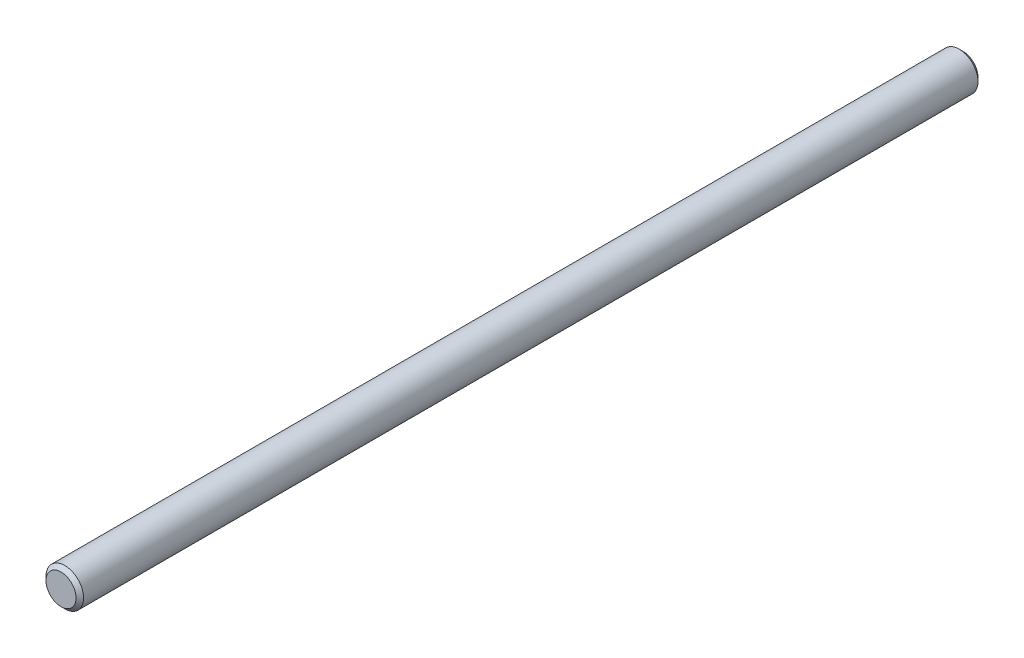
ISO-10303-21;
HEADER;
FILE_DESCRIPTION(('STEP AP214'),'2;1');
FILE_NAME('part.step','',(''),(''),'','','');
FILE_SCHEMA(('AUTOMOTIVE_DESIGN { 1 0 10303 214 1 1 1 1 }'));
ENDSEC;
DATA;
#1=APPLICATION_CONTEXT('core data for automotive mechanical design processes');
#2=APPLICATION_PROTOCOL_DEFINITION('international standard','automotive_design',2000,#1);
#3=PRODUCT_CONTEXT('',#1,'mechanical');
#4=PRODUCT('Part','Part','',(#3));
#5=PRODUCT_RELATED_PRODUCT_CATEGORY('part','',(#4));
#6=PRODUCT_DEFINITION_FORMATION('','',#4);
#7=PRODUCT_DEFINITION_CONTEXT('part definition',#1,'design');
#8=PRODUCT_DEFINITION('design','',#6,#7);
#9=PRODUCT_DEFINITION_SHAPE('','',#8);
#10=(LENGTH_UNIT() NAMED_UNIT(*) SI_UNIT(.MILLI.,.METRE.));
#11=(NAMED_UNIT(*) PLANE_ANGLE_UNIT() SI_UNIT($,.RADIAN.));
#12=(NAMED_UNIT(*) SI_UNIT($,.STERADIAN.) SOLID_ANGLE_UNIT());
#13=UNCERTAINTY_MEASURE_WITH_UNIT(LENGTH_MEASURE(1.E-05),#10,'distance_accuracy_value','');
#14=(GEOMETRIC_REPRESENTATION_CONTEXT(3) GLOBAL_UNCERTAINTY_ASSIGNED_CONTEXT((#13)) GLOBAL_UNIT_ASSIGNED_CONTEXT((#10,
#11,#12)) REPRESENTATION_CONTEXT('',''));
#15=CARTESIAN_POINT('',(0.,0.,0.));
#16=DIRECTION('',(0.,0.,1.));
#17=DIRECTION('',(1.,0.,0.));
#18=AXIS2_PLACEMENT_3D('',#15,#16,#17);
#19=CARTESIAN_POINT('',(0.,0.,152.4));
#20=DIRECTION('',(0.,0.,-1.));
#21=DIRECTION('',(-1.,0.,0.));
#22=AXIS2_PLACEMENT_3D('',#19,#20,#21);
#23=CYLINDRICAL_SURFACE('',#22,6.35);
#24=CARTESIAN_POINT('',(0.,0.,-151.13));
#25=DIRECTION('',(0.,0.,1.));
#26=DIRECTION('',(1.,0.,0.));
#27=AXIS2_PLACEMENT_3D('',#24,#25,#26);
#28=CIRCLE('',#27,6.35);
#29=CARTESIAN_POINT('',(6.35,0.,-151.13));
#30=VERTEX_POINT('',#29);
#31=EDGE_CURVE('E44',#30,#30,#28,.T.);
#32=ORIENTED_EDGE('',*,*,#31,.T.);
#33=EDGE_LOOP('',(#32));
#34=FACE_BOUND('',#33,.T.);
#35=CARTESIAN_POINT('',(0.,0.,151.13));
#36=DIRECTION('',(0.,0.,1.));
#37=DIRECTION('',(1.,0.,0.));
#38=AXIS2_PLACEMENT_3D('',#35,#36,#37);
#39=CIRCLE('',#38,6.35);
#40=CARTESIAN_POINT('',(6.35,0.,151.13));
#41=VERTEX_POINT('',#40);
#42=EDGE_CURVE('E48',#41,#41,#39,.F.);
#43=ORIENTED_EDGE('',*,*,#42,.T.);
#44=EDGE_LOOP('',(#43));
#45=FACE_BOUND('',#44,.T.);
#46=ADVANCED_FACE('F33',(#34,#45),#23,.T.);
#47=CARTESIAN_POINT('',(0.,0.,152.4));
#48=DIRECTION('',(0.,0.,1.));
#49=DIRECTION('',(1.,0.,0.));
#50=AXIS2_PLACEMENT_3D('',#47,#48,#49);
#51=PLANE('',#50);
#52=CARTESIAN_POINT('',(0.,0.,152.4));
#53=DIRECTION('',(0.,0.,1.));
#54=DIRECTION('',(1.,0.,0.));
#55=AXIS2_PLACEMENT_3D('',#52,#53,#54);
#56=CIRCLE('',#55,5.08000000000017);
#57=CARTESIAN_POINT('',(5.08000000000017,0.,152.4));
#58=VERTEX_POINT('',#57);
#59=EDGE_CURVE('E10',#58,#58,#56,.T.);
#60=ORIENTED_EDGE('',*,*,#59,.T.);
#61=EDGE_LOOP('',(#60));
#62=FACE_BOUND('',#61,.T.);
#63=ADVANCED_FACE('F64',(#62),#51,.T.);
#64=CARTESIAN_POINT('',(0.,0.,-152.4));
#65=DIRECTION('',(0.,0.,1.));
#66=DIRECTION('',(1.,0.,0.));
#67=AXIS2_PLACEMENT_3D('',#64,#65,#66);
#68=PLANE('',#67);
#69=CARTESIAN_POINT('',(0.,0.,-152.4));
#70=DIRECTION('',(0.,0.,1.));
#71=DIRECTION('',(1.,0.,0.));
#72=AXIS2_PLACEMENT_3D('',#69,#70,#71);
#73=CIRCLE('',#72,5.07999999999975);
#74=CARTESIAN_POINT('',(5.07999999999975,0.,-152.4));
#75=VERTEX_POINT('',#74);
#76=EDGE_CURVE('E40',#75,#75,#73,.F.);
#77=ORIENTED_EDGE('',*,*,#76,.T.);
#78=EDGE_LOOP('',(#77));
#79=FACE_BOUND('',#78,.T.);
#80=ADVANCED_FACE('F61',(#79),#68,.F.);
#81=CARTESIAN_POINT('',(0.,0.,-151.13));
#82=DIRECTION('',(0.,0.,1.));
#83=DIRECTION('',(1.,0.,0.));
#84=AXIS2_PLACEMENT_3D('',#81,#82,#83);
#85=CONICAL_SURFACE('',#84,6.35,0.78539816339744);
#86=ORIENTED_EDGE('',*,*,#76,.F.);
#87=EDGE_LOOP('',(#86));
#88=FACE_BOUND('',#87,.T.);
#89=ORIENTED_EDGE('',*,*,#31,.F.);
#90=EDGE_LOOP('',(#89));
#91=FACE_BOUND('',#90,.T.);
#92=ADVANCED_FACE('F57',(#88,#91),#85,.T.);
#93=CARTESIAN_POINT('',(0.,0.,152.4));
#94=DIRECTION('',(0.,0.,-1.));
#95=DIRECTION('',(-1.,0.,0.));
#96=AXIS2_PLACEMENT_3D('',#93,#94,#95);
#97=CONICAL_SURFACE('',#96,5.08000000000017,0.785398163397451);
#98=ORIENTED_EDGE('',*,*,#42,.F.);
#99=EDGE_LOOP('',(#98));
#100=FACE_BOUND('',#99,.T.);
#101=ORIENTED_EDGE('',*,*,#59,.F.);
#102=EDGE_LOOP('',(#101));
#103=FACE_BOUND('',#102,.T.);
#104=ADVANCED_FACE('F35',(#100,#103),#97,.T.);
#105=CLOSED_SHELL('',(#46,#63,#80,#92,#104));
#106=MANIFOLD_SOLID_BREP('B2',#105);
#107=ADVANCED_BREP_SHAPE_REPRESENTATION('',(#18,#106),#14);
#108=SHAPE_DEFINITION_REPRESENTATION(#9,#107);
ENDSEC;
END-ISO-10303-21;
